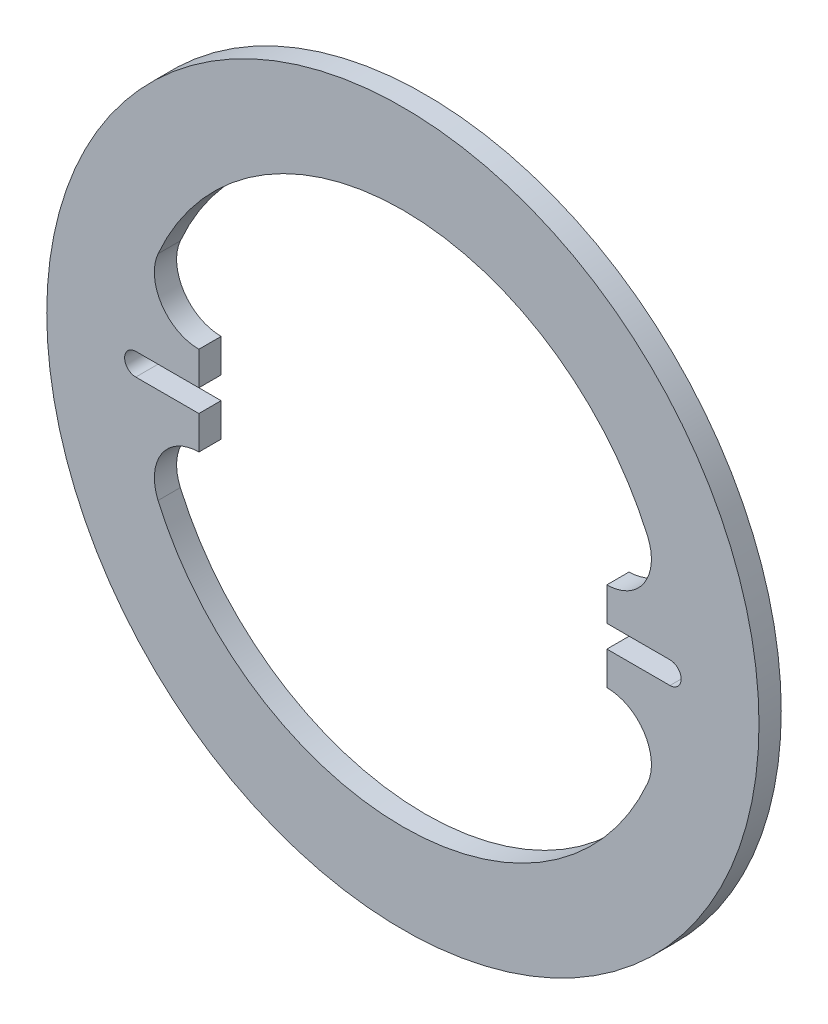
ISO-10303-21;
HEADER;
FILE_DESCRIPTION(('STEP AP214'),'2;1');
FILE_NAME('part.step','',(''),(''),'','','');
FILE_SCHEMA(('AUTOMOTIVE_DESIGN { 1 0 10303 214 1 1 1 1 }'));
ENDSEC;
DATA;
#1=APPLICATION_CONTEXT('core data for automotive mechanical design processes');
#2=APPLICATION_PROTOCOL_DEFINITION('international standard','automotive_design',2000,#1);
#3=PRODUCT_CONTEXT('',#1,'mechanical');
#4=PRODUCT('Part','Part','',(#3));
#5=PRODUCT_RELATED_PRODUCT_CATEGORY('part','',(#4));
#6=PRODUCT_DEFINITION_FORMATION('','',#4);
#7=PRODUCT_DEFINITION_CONTEXT('part definition',#1,'design');
#8=PRODUCT_DEFINITION('design','',#6,#7);
#9=PRODUCT_DEFINITION_SHAPE('','',#8);
#10=(LENGTH_UNIT() NAMED_UNIT(*) SI_UNIT(.MILLI.,.METRE.));
#11=(NAMED_UNIT(*) PLANE_ANGLE_UNIT() SI_UNIT($,.RADIAN.));
#12=(NAMED_UNIT(*) SI_UNIT($,.STERADIAN.) SOLID_ANGLE_UNIT());
#13=UNCERTAINTY_MEASURE_WITH_UNIT(LENGTH_MEASURE(1.E-05),#10,'distance_accuracy_value','');
#14=(GEOMETRIC_REPRESENTATION_CONTEXT(3) GLOBAL_UNCERTAINTY_ASSIGNED_CONTEXT((#13)) GLOBAL_UNIT_ASSIGNED_CONTEXT((#10,
#11,#12)) REPRESENTATION_CONTEXT('',''));
#15=CARTESIAN_POINT('',(0.,0.,0.));
#16=DIRECTION('',(0.,0.,1.));
#17=DIRECTION('',(1.,0.,0.));
#18=AXIS2_PLACEMENT_3D('',#15,#16,#17);
#19=CARTESIAN_POINT('',(0.,0.,6.35));
#20=DIRECTION('',(0.,0.,1.));
#21=DIRECTION('',(1.,0.,0.));
#22=AXIS2_PLACEMENT_3D('',#19,#20,#21);
#23=PLANE('',#22);
#24=DIRECTION('',(0.,-1.,0.));
#25=VECTOR('',#24,1.);
#26=CARTESIAN_POINT('',(-58.1987113259392,-12.7,6.35));
#27=LINE('',#26,#25);
#28=CARTESIAN_POINT('',(-58.198711325939,12.7,6.35));
#29=VERTEX_POINT('',#28);
#30=CARTESIAN_POINT('',(-58.1987113259392,3.17500000000001,6.35));
#31=VERTEX_POINT('',#30);
#32=EDGE_CURVE('E55',#29,#31,#27,.T.);
#33=ORIENTED_EDGE('',*,*,#32,.F.);
#34=CARTESIAN_POINT('',(-58.1987113259392,25.4,6.35));
#35=DIRECTION('',(0.,0.,1.));
#36=DIRECTION('',(1.,0.,0.));
#37=AXIS2_PLACEMENT_3D('',#34,#35,#36);
#38=CIRCLE('',#37,12.7);
#39=CARTESIAN_POINT('',(-69.838453591127,30.48,6.35));
#40=VERTEX_POINT('',#39);
#41=EDGE_CURVE('E214',#40,#29,#38,.T.);
#42=ORIENTED_EDGE('',*,*,#41,.F.);
#43=CARTESIAN_POINT('',(0.,0.,6.35));
#44=DIRECTION('',(0.,0.,1.));
#45=DIRECTION('',(1.,0.,0.));
#46=AXIS2_PLACEMENT_3D('',#43,#44,#45);
#47=CIRCLE('',#46,76.2);
#48=CARTESIAN_POINT('',(69.838453591127,30.48,6.35));
#49=VERTEX_POINT('',#48);
#50=EDGE_CURVE('E224',#49,#40,#47,.T.);
#51=ORIENTED_EDGE('',*,*,#50,.F.);
#52=CARTESIAN_POINT('',(58.1987113259392,25.4,6.35));
#53=DIRECTION('',(0.,0.,1.));
#54=DIRECTION('',(1.,0.,0.));
#55=AXIS2_PLACEMENT_3D('',#52,#53,#54);
#56=CIRCLE('',#55,12.7);
#57=CARTESIAN_POINT('',(58.1987113259393,12.7,6.35));
#58=VERTEX_POINT('',#57);
#59=EDGE_CURVE('E207',#58,#49,#56,.T.);
#60=ORIENTED_EDGE('',*,*,#59,.F.);
#61=DIRECTION('',(0.,1.,0.));
#62=VECTOR('',#61,1.);
#63=CARTESIAN_POINT('',(58.1987113259393,12.7,6.35));
#64=LINE('',#63,#62);
#65=CARTESIAN_POINT('',(58.1987113259392,3.175,6.35));
#66=VERTEX_POINT('',#65);
#67=EDGE_CURVE('E332',#66,#58,#64,.T.);
#68=ORIENTED_EDGE('',*,*,#67,.F.);
#69=DIRECTION('',(-1.,0.,0.));
#70=VECTOR('',#69,1.);
#71=CARTESIAN_POINT('',(76.2,3.17500000000001,6.35));
#72=LINE('',#71,#70);
#73=CARTESIAN_POINT('',(76.2,3.17500000000001,6.35));
#74=VERTEX_POINT('',#73);
#75=EDGE_CURVE('E254',#74,#66,#72,.T.);
#76=ORIENTED_EDGE('',*,*,#75,.F.);
#77=CARTESIAN_POINT('',(76.2,0.,6.35));
#78=DIRECTION('',(0.,0.,1.));
#79=DIRECTION('',(1.,0.,0.));
#80=AXIS2_PLACEMENT_3D('',#77,#78,#79);
#81=CIRCLE('',#80,3.17500000000001);
#82=CARTESIAN_POINT('',(76.2,-3.175,6.35));
#83=VERTEX_POINT('',#82);
#84=EDGE_CURVE('E272',#83,#74,#81,.T.);
#85=ORIENTED_EDGE('',*,*,#84,.F.);
#86=DIRECTION('',(1.,0.,0.));
#87=VECTOR('',#86,1.);
#88=CARTESIAN_POINT('',(76.2,-3.175,6.35));
#89=LINE('',#88,#87);
#90=CARTESIAN_POINT('',(58.1987113259393,-3.17500000000001,6.35));
#91=VERTEX_POINT('',#90);
#92=EDGE_CURVE('E268',#91,#83,#89,.T.);
#93=ORIENTED_EDGE('',*,*,#92,.F.);
#94=CARTESIAN_POINT('',(58.1987113259391,-12.7,6.35));
#95=VERTEX_POINT('',#94);
#96=EDGE_CURVE('E328',#95,#91,#64,.T.);
#97=ORIENTED_EDGE('',*,*,#96,.F.);
#98=CARTESIAN_POINT('',(58.1987113259392,-25.4,6.35));
#99=DIRECTION('',(0.,0.,-1.));
#100=DIRECTION('',(1.,0.,0.));
#101=AXIS2_PLACEMENT_3D('',#98,#99,#100);
#102=CIRCLE('',#101,12.7);
#103=CARTESIAN_POINT('',(69.838453591127,-30.48,6.35));
#104=VERTEX_POINT('',#103);
#105=EDGE_CURVE('E170',#95,#104,#102,.T.);
#106=ORIENTED_EDGE('',*,*,#105,.T.);
#107=CARTESIAN_POINT('',(0.,0.,6.35));
#108=DIRECTION('',(0.,0.,-1.));
#109=DIRECTION('',(1.,0.,0.));
#110=AXIS2_PLACEMENT_3D('',#107,#108,#109);
#111=CIRCLE('',#110,76.2);
#112=CARTESIAN_POINT('',(-69.838453591127,-30.48,6.35));
#113=VERTEX_POINT('',#112);
#114=EDGE_CURVE('E182',#104,#113,#111,.T.);
#115=ORIENTED_EDGE('',*,*,#114,.T.);
#116=CARTESIAN_POINT('',(-58.1987113259392,-25.4,6.35));
#117=DIRECTION('',(0.,0.,-1.));
#118=DIRECTION('',(1.,0.,0.));
#119=AXIS2_PLACEMENT_3D('',#116,#117,#118);
#120=CIRCLE('',#119,12.7);
#121=CARTESIAN_POINT('',(-58.1987113259392,-12.7,6.35));
#122=VERTEX_POINT('',#121);
#123=EDGE_CURVE('E189',#113,#122,#120,.T.);
#124=ORIENTED_EDGE('',*,*,#123,.T.);
#125=CARTESIAN_POINT('',(-58.1987113259392,-3.17500000000001,6.35));
#126=VERTEX_POINT('',#125);
#127=EDGE_CURVE('E324',#126,#122,#27,.T.);
#128=ORIENTED_EDGE('',*,*,#127,.F.);
#129=DIRECTION('',(1.,0.,0.));
#130=VECTOR('',#129,1.);
#131=CARTESIAN_POINT('',(-76.2,-3.175,6.35));
#132=LINE('',#131,#130);
#133=CARTESIAN_POINT('',(-76.2,-3.175,6.35));
#134=VERTEX_POINT('',#133);
#135=EDGE_CURVE('E302',#134,#126,#132,.T.);
#136=ORIENTED_EDGE('',*,*,#135,.F.);
#137=CARTESIAN_POINT('',(-76.2,0.,6.35));
#138=DIRECTION('',(0.,0.,1.));
#139=DIRECTION('',(-1.,0.,0.));
#140=AXIS2_PLACEMENT_3D('',#137,#138,#139);
#141=CIRCLE('',#140,3.17500000000001);
#142=CARTESIAN_POINT('',(-76.2,3.17500000000001,6.35));
#143=VERTEX_POINT('',#142);
#144=EDGE_CURVE('E298',#143,#134,#141,.T.);
#145=ORIENTED_EDGE('',*,*,#144,.F.);
#146=DIRECTION('',(-1.,0.,0.));
#147=VECTOR('',#146,1.);
#148=CARTESIAN_POINT('',(-76.2,3.17500000000001,6.35));
#149=LINE('',#148,#147);
#150=EDGE_CURVE('E291',#31,#143,#149,.T.);
#151=ORIENTED_EDGE('',*,*,#150,.F.);
#152=EDGE_LOOP('',(#33,#42,#51,#60,#68,#76,#85,#93,#97,#106,#115,#124,#128,#136,#145,#151));
#153=FACE_BOUND('',#152,.T.);
#154=CARTESIAN_POINT('',(0.,0.,6.35));
#155=DIRECTION('',(0.,0.,1.));
#156=DIRECTION('',(1.,0.,0.));
#157=AXIS2_PLACEMENT_3D('',#154,#155,#156);
#158=CIRCLE('',#157,101.6);
#159=CARTESIAN_POINT('',(101.6,0.,6.35));
#160=VERTEX_POINT('',#159);
#161=EDGE_CURVE('E238',#160,#160,#158,.T.);
#162=ORIENTED_EDGE('',*,*,#161,.T.);
#163=EDGE_LOOP('',(#162));
#164=FACE_BOUND('',#163,.T.);
#165=ADVANCED_FACE('F39',(#153,#164),#23,.T.);
#166=CARTESIAN_POINT('',(0.,0.,0.));
#167=DIRECTION('',(0.,0.,1.));
#168=DIRECTION('',(1.,0.,0.));
#169=AXIS2_PLACEMENT_3D('',#166,#167,#168);
#170=PLANE('',#169);
#171=CARTESIAN_POINT('',(0.,0.,0.));
#172=DIRECTION('',(0.,0.,1.));
#173=DIRECTION('',(1.,0.,0.));
#174=AXIS2_PLACEMENT_3D('',#171,#172,#173);
#175=CIRCLE('',#174,101.6);
#176=CARTESIAN_POINT('',(101.6,0.,0.));
#177=VERTEX_POINT('',#176);
#178=EDGE_CURVE('E234',#177,#177,#175,.T.);
#179=ORIENTED_EDGE('',*,*,#178,.F.);
#180=EDGE_LOOP('',(#179));
#181=FACE_BOUND('',#180,.T.);
#182=CARTESIAN_POINT('',(-58.1987113259392,25.4,0.));
#183=DIRECTION('',(0.,0.,1.));
#184=DIRECTION('',(1.,0.,0.));
#185=AXIS2_PLACEMENT_3D('',#182,#183,#184);
#186=CIRCLE('',#185,12.7);
#187=CARTESIAN_POINT('',(-69.838453591127,30.48,0.));
#188=VERTEX_POINT('',#187);
#189=CARTESIAN_POINT('',(-58.198711325939,12.7,0.));
#190=VERTEX_POINT('',#189);
#191=EDGE_CURVE('E218',#188,#190,#186,.T.);
#192=ORIENTED_EDGE('',*,*,#191,.T.);
#193=DIRECTION('',(0.,-1.,0.));
#194=VECTOR('',#193,1.);
#195=CARTESIAN_POINT('',(-58.1987113259392,-12.7,0.));
#196=LINE('',#195,#194);
#197=CARTESIAN_POINT('',(-58.1987113259391,3.175,0.));
#198=VERTEX_POINT('',#197);
#199=EDGE_CURVE('E173',#190,#198,#196,.T.);
#200=ORIENTED_EDGE('',*,*,#199,.T.);
#201=DIRECTION('',(-1.,0.,0.));
#202=VECTOR('',#201,1.);
#203=CARTESIAN_POINT('',(-76.2,3.17500000000001,0.));
#204=LINE('',#203,#202);
#205=CARTESIAN_POINT('',(-76.2,3.17500000000001,0.));
#206=VERTEX_POINT('',#205);
#207=EDGE_CURVE('E295',#198,#206,#204,.T.);
#208=ORIENTED_EDGE('',*,*,#207,.T.);
#209=CARTESIAN_POINT('',(-76.2,0.,0.));
#210=DIRECTION('',(0.,0.,1.));
#211=DIRECTION('',(-1.,0.,0.));
#212=AXIS2_PLACEMENT_3D('',#209,#210,#211);
#213=CIRCLE('',#212,3.17500000000001);
#214=CARTESIAN_POINT('',(-76.2,-3.175,0.));
#215=VERTEX_POINT('',#214);
#216=EDGE_CURVE('E286',#206,#215,#213,.T.);
#217=ORIENTED_EDGE('',*,*,#216,.T.);
#218=DIRECTION('',(1.,0.,0.));
#219=VECTOR('',#218,1.);
#220=CARTESIAN_POINT('',(-76.2,-3.175,0.));
#221=LINE('',#220,#219);
#222=CARTESIAN_POINT('',(-58.1987113259392,-3.17500000000001,0.));
#223=VERTEX_POINT('',#222);
#224=EDGE_CURVE('E290',#215,#223,#221,.T.);
#225=ORIENTED_EDGE('',*,*,#224,.T.);
#226=CARTESIAN_POINT('',(-58.1987113259392,-12.7,0.));
#227=VERTEX_POINT('',#226);
#228=EDGE_CURVE('E63',#223,#227,#196,.T.);
#229=ORIENTED_EDGE('',*,*,#228,.T.);
#230=CARTESIAN_POINT('',(-58.1987113259392,-25.4,0.));
#231=DIRECTION('',(0.,0.,-1.));
#232=DIRECTION('',(1.,0.,0.));
#233=AXIS2_PLACEMENT_3D('',#230,#231,#232);
#234=CIRCLE('',#233,12.7);
#235=CARTESIAN_POINT('',(-69.838453591127,-30.48,0.));
#236=VERTEX_POINT('',#235);
#237=EDGE_CURVE('E181',#236,#227,#234,.T.);
#238=ORIENTED_EDGE('',*,*,#237,.F.);
#239=CARTESIAN_POINT('',(0.,0.,0.));
#240=DIRECTION('',(0.,0.,-1.));
#241=DIRECTION('',(1.,0.,0.));
#242=AXIS2_PLACEMENT_3D('',#239,#240,#241);
#243=CIRCLE('',#242,76.2);
#244=CARTESIAN_POINT('',(69.838453591127,-30.48,0.));
#245=VERTEX_POINT('',#244);
#246=EDGE_CURVE('E179',#245,#236,#243,.T.);
#247=ORIENTED_EDGE('',*,*,#246,.F.);
#248=CARTESIAN_POINT('',(58.1987113259392,-25.4,0.));
#249=DIRECTION('',(0.,0.,-1.));
#250=DIRECTION('',(1.,0.,0.));
#251=AXIS2_PLACEMENT_3D('',#248,#249,#250);
#252=CIRCLE('',#251,12.7);
#253=CARTESIAN_POINT('',(58.1987113259391,-12.7,0.));
#254=VERTEX_POINT('',#253);
#255=EDGE_CURVE('E168',#254,#245,#252,.T.);
#256=ORIENTED_EDGE('',*,*,#255,.F.);
#257=DIRECTION('',(0.,1.,0.));
#258=VECTOR('',#257,1.);
#259=CARTESIAN_POINT('',(58.1987113259393,12.7,0.));
#260=LINE('',#259,#258);
#261=CARTESIAN_POINT('',(58.1987113259392,-3.17500000000001,0.));
#262=VERTEX_POINT('',#261);
#263=EDGE_CURVE('E151',#254,#262,#260,.T.);
#264=ORIENTED_EDGE('',*,*,#263,.T.);
#265=DIRECTION('',(1.,0.,0.));
#266=VECTOR('',#265,1.);
#267=CARTESIAN_POINT('',(76.2,-3.175,0.));
#268=LINE('',#267,#266);
#269=CARTESIAN_POINT('',(76.2,-3.175,0.));
#270=VERTEX_POINT('',#269);
#271=EDGE_CURVE('E262',#262,#270,#268,.T.);
#272=ORIENTED_EDGE('',*,*,#271,.T.);
#273=CARTESIAN_POINT('',(76.2,0.,0.));
#274=DIRECTION('',(0.,0.,1.));
#275=DIRECTION('',(1.,0.,0.));
#276=AXIS2_PLACEMENT_3D('',#273,#274,#275);
#277=CIRCLE('',#276,3.17500000000001);
#278=CARTESIAN_POINT('',(76.2,3.17500000000001,0.));
#279=VERTEX_POINT('',#278);
#280=EDGE_CURVE('E260',#270,#279,#277,.T.);
#281=ORIENTED_EDGE('',*,*,#280,.T.);
#282=DIRECTION('',(-1.,0.,0.));
#283=VECTOR('',#282,1.);
#284=CARTESIAN_POINT('',(76.2,3.17500000000001,0.));
#285=LINE('',#284,#283);
#286=CARTESIAN_POINT('',(58.1987113259393,3.17500000000001,0.));
#287=VERTEX_POINT('',#286);
#288=EDGE_CURVE('E251',#279,#287,#285,.T.);
#289=ORIENTED_EDGE('',*,*,#288,.T.);
#290=CARTESIAN_POINT('',(58.1987113259393,12.7,0.));
#291=VERTEX_POINT('',#290);
#292=EDGE_CURVE('E162',#287,#291,#260,.T.);
#293=ORIENTED_EDGE('',*,*,#292,.T.);
#294=CARTESIAN_POINT('',(58.1987113259392,25.4,0.));
#295=DIRECTION('',(0.,0.,1.));
#296=DIRECTION('',(1.,0.,0.));
#297=AXIS2_PLACEMENT_3D('',#294,#295,#296);
#298=CIRCLE('',#297,12.7);
#299=CARTESIAN_POINT('',(69.838453591127,30.48,0.));
#300=VERTEX_POINT('',#299);
#301=EDGE_CURVE('E210',#291,#300,#298,.T.);
#302=ORIENTED_EDGE('',*,*,#301,.T.);
#303=CARTESIAN_POINT('',(0.,0.,0.));
#304=DIRECTION('',(0.,0.,1.));
#305=DIRECTION('',(1.,0.,0.));
#306=AXIS2_PLACEMENT_3D('',#303,#304,#305);
#307=CIRCLE('',#306,76.2);
#308=EDGE_CURVE('E213',#300,#188,#307,.T.);
#309=ORIENTED_EDGE('',*,*,#308,.T.);
#310=EDGE_LOOP('',(#192,#200,#208,#217,#225,#229,#238,#247,#256,#264,#272,#281,#289,#293,#302,#309));
#311=FACE_BOUND('',#310,.T.);
#312=ADVANCED_FACE('F177',(#181,#311),#170,.F.);
#313=CARTESIAN_POINT('',(0.,0.,6.35));
#314=DIRECTION('',(0.,0.,-1.));
#315=DIRECTION('',(-1.,0.,0.));
#316=AXIS2_PLACEMENT_3D('',#313,#314,#315);
#317=CYLINDRICAL_SURFACE('',#316,101.6);
#318=ORIENTED_EDGE('',*,*,#161,.F.);
#319=EDGE_LOOP('',(#318));
#320=FACE_BOUND('',#319,.T.);
#321=ORIENTED_EDGE('',*,*,#178,.T.);
#322=EDGE_LOOP('',(#321));
#323=FACE_BOUND('',#322,.T.);
#324=ADVANCED_FACE('F41',(#320,#323),#317,.T.);
#325=CARTESIAN_POINT('',(58.1987113259392,25.4,0.));
#326=DIRECTION('',(0.,0.,1.));
#327=DIRECTION('',(1.,0.,0.));
#328=AXIS2_PLACEMENT_3D('',#325,#326,#327);
#329=CYLINDRICAL_SURFACE('',#328,12.7);
#330=ORIENTED_EDGE('',*,*,#301,.F.);
#331=DIRECTION('',(0.,0.,1.));
#332=VECTOR('',#331,1.);
#333=CARTESIAN_POINT('',(58.1987113259393,12.7,0.));
#334=LINE('',#333,#332);
#335=EDGE_CURVE('E172',#291,#58,#334,.T.);
#336=ORIENTED_EDGE('',*,*,#335,.T.);
#337=ORIENTED_EDGE('',*,*,#59,.T.);
#338=DIRECTION('',(0.,0.,1.));
#339=VECTOR('',#338,1.);
#340=CARTESIAN_POINT('',(69.838453591127,30.48,0.));
#341=LINE('',#340,#339);
#342=EDGE_CURVE('E221',#300,#49,#341,.T.);
#343=ORIENTED_EDGE('',*,*,#342,.F.);
#344=EDGE_LOOP('',(#330,#336,#337,#343));
#345=FACE_BOUND('',#344,.T.);
#346=ADVANCED_FACE('F363',(#345),#329,.F.);
#347=CARTESIAN_POINT('',(-58.1987113259392,25.4,0.));
#348=DIRECTION('',(0.,0.,1.));
#349=DIRECTION('',(1.,0.,0.));
#350=AXIS2_PLACEMENT_3D('',#347,#348,#349);
#351=CYLINDRICAL_SURFACE('',#350,12.7);
#352=ORIENTED_EDGE('',*,*,#41,.T.);
#353=DIRECTION('',(0.,0.,1.));
#354=VECTOR('',#353,1.);
#355=CARTESIAN_POINT('',(-58.198711325939,12.7,0.));
#356=LINE('',#355,#354);
#357=EDGE_CURVE('E339',#190,#29,#356,.T.);
#358=ORIENTED_EDGE('',*,*,#357,.F.);
#359=ORIENTED_EDGE('',*,*,#191,.F.);
#360=DIRECTION('',(0.,0.,1.));
#361=VECTOR('',#360,1.);
#362=CARTESIAN_POINT('',(-69.838453591127,30.48,0.));
#363=LINE('',#362,#361);
#364=EDGE_CURVE('E231',#188,#40,#363,.T.);
#365=ORIENTED_EDGE('',*,*,#364,.T.);
#366=EDGE_LOOP('',(#352,#358,#359,#365));
#367=FACE_BOUND('',#366,.T.);
#368=ADVANCED_FACE('F355',(#367),#351,.F.);
#369=CARTESIAN_POINT('',(0.,0.,0.));
#370=DIRECTION('',(0.,0.,1.));
#371=DIRECTION('',(1.,0.,0.));
#372=AXIS2_PLACEMENT_3D('',#369,#370,#371);
#373=CYLINDRICAL_SURFACE('',#372,76.2);
#374=ORIENTED_EDGE('',*,*,#50,.T.);
#375=ORIENTED_EDGE('',*,*,#364,.F.);
#376=ORIENTED_EDGE('',*,*,#308,.F.);
#377=ORIENTED_EDGE('',*,*,#342,.T.);
#378=EDGE_LOOP('',(#374,#375,#376,#377));
#379=FACE_BOUND('',#378,.T.);
#380=ADVANCED_FACE('F359',(#379),#373,.F.);
#381=CARTESIAN_POINT('',(58.1987113259392,-25.4,0.));
#382=DIRECTION('',(0.,0.,1.));
#383=DIRECTION('',(1.,0.,0.));
#384=AXIS2_PLACEMENT_3D('',#381,#382,#383);
#385=CYLINDRICAL_SURFACE('',#384,12.7);
#386=DIRECTION('',(0.,0.,1.));
#387=VECTOR('',#386,1.);
#388=CARTESIAN_POINT('',(58.1987113259391,-12.7,0.));
#389=LINE('',#388,#387);
#390=EDGE_CURVE('E154',#254,#95,#389,.T.);
#391=ORIENTED_EDGE('',*,*,#390,.F.);
#392=ORIENTED_EDGE('',*,*,#255,.T.);
#393=DIRECTION('',(0.,0.,1.));
#394=VECTOR('',#393,1.);
#395=CARTESIAN_POINT('',(69.838453591127,-30.48,0.));
#396=LINE('',#395,#394);
#397=EDGE_CURVE('E204',#245,#104,#396,.T.);
#398=ORIENTED_EDGE('',*,*,#397,.T.);
#399=ORIENTED_EDGE('',*,*,#105,.F.);
#400=EDGE_LOOP('',(#391,#392,#398,#399));
#401=FACE_BOUND('',#400,.T.);
#402=ADVANCED_FACE('F166',(#401),#385,.F.);
#403=CARTESIAN_POINT('',(0.,0.,0.));
#404=DIRECTION('',(0.,0.,1.));
#405=DIRECTION('',(1.,0.,0.));
#406=AXIS2_PLACEMENT_3D('',#403,#404,#405);
#407=CYLINDRICAL_SURFACE('',#406,76.2);
#408=ORIENTED_EDGE('',*,*,#114,.F.);
#409=ORIENTED_EDGE('',*,*,#397,.F.);
#410=ORIENTED_EDGE('',*,*,#246,.T.);
#411=DIRECTION('',(0.,0.,1.));
#412=VECTOR('',#411,1.);
#413=CARTESIAN_POINT('',(-69.838453591127,-30.48,0.));
#414=LINE('',#413,#412);
#415=EDGE_CURVE('E197',#236,#113,#414,.T.);
#416=ORIENTED_EDGE('',*,*,#415,.T.);
#417=EDGE_LOOP('',(#408,#409,#410,#416));
#418=FACE_BOUND('',#417,.T.);
#419=ADVANCED_FACE('F374',(#418),#407,.F.);
#420=CARTESIAN_POINT('',(-58.1987113259392,-25.4,0.));
#421=DIRECTION('',(0.,0.,1.));
#422=DIRECTION('',(1.,0.,0.));
#423=AXIS2_PLACEMENT_3D('',#420,#421,#422);
#424=CYLINDRICAL_SURFACE('',#423,12.7);
#425=DIRECTION('',(0.,0.,1.));
#426=VECTOR('',#425,1.);
#427=CARTESIAN_POINT('',(-58.1987113259392,-12.7,0.));
#428=LINE('',#427,#426);
#429=EDGE_CURVE('E336',#227,#122,#428,.T.);
#430=ORIENTED_EDGE('',*,*,#429,.T.);
#431=ORIENTED_EDGE('',*,*,#123,.F.);
#432=ORIENTED_EDGE('',*,*,#415,.F.);
#433=ORIENTED_EDGE('',*,*,#237,.T.);
#434=EDGE_LOOP('',(#430,#431,#432,#433));
#435=FACE_BOUND('',#434,.T.);
#436=ADVANCED_FACE('F371',(#435),#424,.F.);
#437=CARTESIAN_POINT('',(-76.2,0.,0.));
#438=DIRECTION('',(0.,0.,1.));
#439=DIRECTION('',(1.,0.,0.));
#440=AXIS2_PLACEMENT_3D('',#437,#438,#439);
#441=CYLINDRICAL_SURFACE('',#440,3.17500000000001);
#442=ORIENTED_EDGE('',*,*,#144,.T.);
#443=DIRECTION('',(0.,0.,1.));
#444=VECTOR('',#443,1.);
#445=CARTESIAN_POINT('',(-76.2,-3.175,0.));
#446=LINE('',#445,#444);
#447=EDGE_CURVE('E192',#215,#134,#446,.T.);
#448=ORIENTED_EDGE('',*,*,#447,.F.);
#449=ORIENTED_EDGE('',*,*,#216,.F.);
#450=DIRECTION('',(0.,0.,1.));
#451=VECTOR('',#450,1.);
#452=CARTESIAN_POINT('',(-76.2,3.17500000000001,0.));
#453=LINE('',#452,#451);
#454=EDGE_CURVE('E276',#206,#143,#453,.T.);
#455=ORIENTED_EDGE('',*,*,#454,.T.);
#456=EDGE_LOOP('',(#442,#448,#449,#455));
#457=FACE_BOUND('',#456,.T.);
#458=ADVANCED_FACE('F319',(#457),#441,.F.);
#459=CARTESIAN_POINT('',(-76.2,3.17500000000001,0.));
#460=DIRECTION('',(0.,1.,0.));
#461=DIRECTION('',(-1.,0.,0.));
#462=AXIS2_PLACEMENT_3D('',#459,#460,#461);
#463=PLANE('',#462);
#464=ORIENTED_EDGE('',*,*,#207,.F.);
#465=DIRECTION('',(0.,0.,1.));
#466=VECTOR('',#465,1.);
#467=CARTESIAN_POINT('',(-58.1987113259391,3.17500000000001,0.));
#468=LINE('',#467,#466);
#469=EDGE_CURVE('E303',#198,#31,#468,.T.);
#470=ORIENTED_EDGE('',*,*,#469,.T.);
#471=ORIENTED_EDGE('',*,*,#150,.T.);
#472=ORIENTED_EDGE('',*,*,#454,.F.);
#473=EDGE_LOOP('',(#464,#470,#471,#472));
#474=FACE_BOUND('',#473,.T.);
#475=ADVANCED_FACE('F349',(#474),#463,.F.);
#476=CARTESIAN_POINT('',(-76.2,-3.175,0.));
#477=DIRECTION('',(0.,-1.,0.));
#478=DIRECTION('',(1.,0.,0.));
#479=AXIS2_PLACEMENT_3D('',#476,#477,#478);
#480=PLANE('',#479);
#481=ORIENTED_EDGE('',*,*,#135,.T.);
#482=DIRECTION('',(0.,0.,-1.));
#483=VECTOR('',#482,1.);
#484=CARTESIAN_POINT('',(-58.1987113259392,-3.17500000000001,0.));
#485=LINE('',#484,#483);
#486=EDGE_CURVE('E11',#126,#223,#485,.T.);
#487=ORIENTED_EDGE('',*,*,#486,.T.);
#488=ORIENTED_EDGE('',*,*,#224,.F.);
#489=ORIENTED_EDGE('',*,*,#447,.T.);
#490=EDGE_LOOP('',(#481,#487,#488,#489));
#491=FACE_BOUND('',#490,.T.);
#492=ADVANCED_FACE('F317',(#491),#480,.F.);
#493=CARTESIAN_POINT('',(76.2,0.,0.));
#494=DIRECTION('',(0.,0.,1.));
#495=DIRECTION('',(1.,0.,0.));
#496=AXIS2_PLACEMENT_3D('',#493,#494,#495);
#497=CYLINDRICAL_SURFACE('',#496,3.17500000000001);
#498=ORIENTED_EDGE('',*,*,#84,.T.);
#499=DIRECTION('',(0.,0.,1.));
#500=VECTOR('',#499,1.);
#501=CARTESIAN_POINT('',(76.2,3.17500000000001,0.));
#502=LINE('',#501,#500);
#503=EDGE_CURVE('E266',#279,#74,#502,.T.);
#504=ORIENTED_EDGE('',*,*,#503,.F.);
#505=ORIENTED_EDGE('',*,*,#280,.F.);
#506=DIRECTION('',(0.,0.,1.));
#507=VECTOR('',#506,1.);
#508=CARTESIAN_POINT('',(76.2,-3.175,0.));
#509=LINE('',#508,#507);
#510=EDGE_CURVE('E200',#270,#83,#509,.T.);
#511=ORIENTED_EDGE('',*,*,#510,.T.);
#512=EDGE_LOOP('',(#498,#504,#505,#511));
#513=FACE_BOUND('',#512,.T.);
#514=ADVANCED_FACE('F381',(#513),#497,.F.);
#515=CARTESIAN_POINT('',(76.2,-3.175,0.));
#516=DIRECTION('',(0.,-1.,0.));
#517=DIRECTION('',(1.,0.,0.));
#518=AXIS2_PLACEMENT_3D('',#515,#516,#517);
#519=PLANE('',#518);
#520=ORIENTED_EDGE('',*,*,#271,.F.);
#521=DIRECTION('',(0.,0.,1.));
#522=VECTOR('',#521,1.);
#523=CARTESIAN_POINT('',(58.1987113259392,-3.17500000000001,0.));
#524=LINE('',#523,#522);
#525=EDGE_CURVE('E157',#262,#91,#524,.T.);
#526=ORIENTED_EDGE('',*,*,#525,.T.);
#527=ORIENTED_EDGE('',*,*,#92,.T.);
#528=ORIENTED_EDGE('',*,*,#510,.F.);
#529=EDGE_LOOP('',(#520,#526,#527,#528));
#530=FACE_BOUND('',#529,.T.);
#531=ADVANCED_FACE('F378',(#530),#519,.F.);
#532=CARTESIAN_POINT('',(76.2,3.17500000000001,0.));
#533=DIRECTION('',(0.,1.,0.));
#534=DIRECTION('',(-1.,0.,0.));
#535=AXIS2_PLACEMENT_3D('',#532,#533,#534);
#536=PLANE('',#535);
#537=ORIENTED_EDGE('',*,*,#75,.T.);
#538=DIRECTION('',(0.,0.,-1.));
#539=VECTOR('',#538,1.);
#540=CARTESIAN_POINT('',(58.1987113259392,3.17500000000001,0.));
#541=LINE('',#540,#539);
#542=EDGE_CURVE('E48',#66,#287,#541,.T.);
#543=ORIENTED_EDGE('',*,*,#542,.T.);
#544=ORIENTED_EDGE('',*,*,#288,.F.);
#545=ORIENTED_EDGE('',*,*,#503,.T.);
#546=EDGE_LOOP('',(#537,#543,#544,#545));
#547=FACE_BOUND('',#546,.T.);
#548=ADVANCED_FACE('F250',(#547),#536,.F.);
#549=CARTESIAN_POINT('',(58.1987113259393,12.7,0.));
#550=DIRECTION('',(1.,0.,0.));
#551=DIRECTION('',(0.,1.,0.));
#552=AXIS2_PLACEMENT_3D('',#549,#550,#551);
#553=PLANE('',#552);
#554=ORIENTED_EDGE('',*,*,#67,.T.);
#555=ORIENTED_EDGE('',*,*,#335,.F.);
#556=ORIENTED_EDGE('',*,*,#292,.F.);
#557=ORIENTED_EDGE('',*,*,#542,.F.);
#558=EDGE_LOOP('',(#554,#555,#556,#557));
#559=FACE_BOUND('',#558,.T.);
#560=ADVANCED_FACE('F364',(#559),#553,.F.);
#561=ORIENTED_EDGE('',*,*,#263,.F.);
#562=ORIENTED_EDGE('',*,*,#390,.T.);
#563=ORIENTED_EDGE('',*,*,#96,.T.);
#564=ORIENTED_EDGE('',*,*,#525,.F.);
#565=EDGE_LOOP('',(#561,#562,#563,#564));
#566=FACE_BOUND('',#565,.T.);
#567=ADVANCED_FACE('F153',(#566),#553,.F.);
#568=CARTESIAN_POINT('',(-58.1987113259392,-12.7,0.));
#569=DIRECTION('',(-1.,0.,0.));
#570=DIRECTION('',(0.,-1.,0.));
#571=AXIS2_PLACEMENT_3D('',#568,#569,#570);
#572=PLANE('',#571);
#573=ORIENTED_EDGE('',*,*,#127,.T.);
#574=ORIENTED_EDGE('',*,*,#429,.F.);
#575=ORIENTED_EDGE('',*,*,#228,.F.);
#576=ORIENTED_EDGE('',*,*,#486,.F.);
#577=EDGE_LOOP('',(#573,#574,#575,#576));
#578=FACE_BOUND('',#577,.T.);
#579=ADVANCED_FACE('F453',(#578),#572,.F.);
#580=ORIENTED_EDGE('',*,*,#199,.F.);
#581=ORIENTED_EDGE('',*,*,#357,.T.);
#582=ORIENTED_EDGE('',*,*,#32,.T.);
#583=ORIENTED_EDGE('',*,*,#469,.F.);
#584=EDGE_LOOP('',(#580,#581,#582,#583));
#585=FACE_BOUND('',#584,.T.);
#586=ADVANCED_FACE('F461',(#585),#572,.F.);
#587=CLOSED_SHELL('',(#165,#312,#324,#346,#368,#380,#402,#419,#436,#458,#475,#492,#514,#531,
#548,#560,#567,#579,#586));
#588=MANIFOLD_SOLID_BREP('B2',#587);
#589=ADVANCED_BREP_SHAPE_REPRESENTATION('',(#18,#588),#14);
#590=SHAPE_DEFINITION_REPRESENTATION(#9,#589);
ENDSEC;
END-ISO-10303-21;
